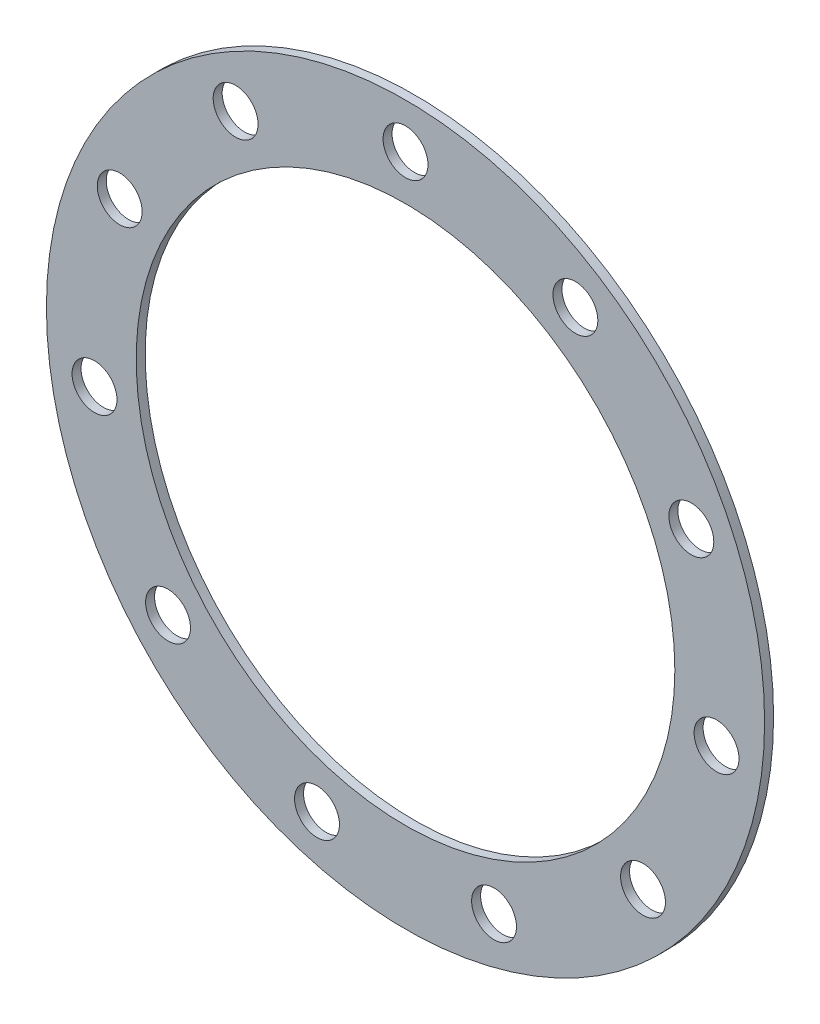
ISO-10303-21;
HEADER;
FILE_DESCRIPTION(('STEP AP214'),'2;1');
FILE_NAME('part.step','',(''),(''),'','','');
FILE_SCHEMA(('AUTOMOTIVE_DESIGN { 1 0 10303 214 1 1 1 1 }'));
ENDSEC;
DATA;
#1=APPLICATION_CONTEXT('core data for automotive mechanical design processes');
#2=APPLICATION_PROTOCOL_DEFINITION('international standard','automotive_design',2000,#1);
#3=PRODUCT_CONTEXT('',#1,'mechanical');
#4=PRODUCT('Part','Part','',(#3));
#5=PRODUCT_RELATED_PRODUCT_CATEGORY('part','',(#4));
#6=PRODUCT_DEFINITION_FORMATION('','',#4);
#7=PRODUCT_DEFINITION_CONTEXT('part definition',#1,'design');
#8=PRODUCT_DEFINITION('design','',#6,#7);
#9=PRODUCT_DEFINITION_SHAPE('','',#8);
#10=(LENGTH_UNIT() NAMED_UNIT(*) SI_UNIT(.MILLI.,.METRE.));
#11=(NAMED_UNIT(*) PLANE_ANGLE_UNIT() SI_UNIT($,.RADIAN.));
#12=(NAMED_UNIT(*) SI_UNIT($,.STERADIAN.) SOLID_ANGLE_UNIT());
#13=UNCERTAINTY_MEASURE_WITH_UNIT(LENGTH_MEASURE(1.E-05),#10,'distance_accuracy_value','');
#14=(GEOMETRIC_REPRESENTATION_CONTEXT(3) GLOBAL_UNCERTAINTY_ASSIGNED_CONTEXT((#13)) GLOBAL_UNIT_ASSIGNED_CONTEXT((#10,
#11,#12)) REPRESENTATION_CONTEXT('',''));
#15=CARTESIAN_POINT('',(0.,0.,0.));
#16=DIRECTION('',(0.,0.,1.));
#17=DIRECTION('',(1.,0.,0.));
#18=AXIS2_PLACEMENT_3D('',#15,#16,#17);
#19=CARTESIAN_POINT('',(0.,0.,1.));
#20=DIRECTION('',(0.,0.,1.));
#21=DIRECTION('',(1.,0.,0.));
#22=AXIS2_PLACEMENT_3D('',#19,#20,#21);
#23=PLANE('',#22);
#24=CARTESIAN_POINT('',(-31.8371198374073,14.5395254550647,1.));
#25=DIRECTION('',(0.,0.,1.));
#26=DIRECTION('',(1.,0.,0.));
#27=AXIS2_PLACEMENT_3D('',#24,#25,#26);
#28=CIRCLE('',#27,2.50000000000164);
#29=CARTESIAN_POINT('',(-29.3371198374056,14.5395254550647,1.));
#30=VERTEX_POINT('',#29);
#31=EDGE_CURVE('E104',#30,#30,#28,.T.);
#32=ORIENTED_EDGE('',*,*,#31,.F.);
#33=EDGE_LOOP('',(#32));
#34=FACE_BOUND('',#33,.T.);
#35=CARTESIAN_POINT('',(-26.4512351023966,-22.9201256880861,1.));
#36=DIRECTION('',(0.,0.,1.));
#37=DIRECTION('',(1.,0.,0.));
#38=AXIS2_PLACEMENT_3D('',#35,#36,#37);
#39=CIRCLE('',#38,2.50000000000299);
#40=CARTESIAN_POINT('',(-23.9512351023936,-22.9201256880861,1.));
#41=VERTEX_POINT('',#40);
#42=EDGE_CURVE('E92',#41,#41,#39,.T.);
#43=ORIENTED_EDGE('',*,*,#42,.F.);
#44=EDGE_LOOP('',(#43));
#45=FACE_BOUND('',#44,.T.);
#46=CARTESIAN_POINT('',(9.86063948945295,-33.582254076507,1.));
#47=DIRECTION('',(0.,0.,1.));
#48=DIRECTION('',(1.,0.,0.));
#49=AXIS2_PLACEMENT_3D('',#46,#47,#48);
#50=CIRCLE('',#49,2.50000000000289);
#51=CARTESIAN_POINT('',(12.3606394894558,-33.582254076507,1.));
#52=VERTEX_POINT('',#51);
#53=EDGE_CURVE('E80',#52,#52,#50,.T.);
#54=ORIENTED_EDGE('',*,*,#53,.F.);
#55=EDGE_LOOP('',(#54));
#56=FACE_BOUND('',#55,.T.);
#57=CARTESIAN_POINT('',(34.6437504658343,-4.98101933956351,1.));
#58=DIRECTION('',(0.,0.,1.));
#59=DIRECTION('',(1.,0.,0.));
#60=AXIS2_PLACEMENT_3D('',#57,#58,#59);
#61=CIRCLE('',#60,2.50000000000133);
#62=CARTESIAN_POINT('',(37.1437504658357,-4.98101933956351,1.));
#63=VERTEX_POINT('',#62);
#64=EDGE_CURVE('E68',#63,#63,#61,.T.);
#65=ORIENTED_EDGE('',*,*,#64,.F.);
#66=EDGE_LOOP('',(#65));
#67=FACE_BOUND('',#66,.T.);
#68=CARTESIAN_POINT('',(18.922428610946,29.4438736490913,1.));
#69=DIRECTION('',(0.,0.,1.));
#70=DIRECTION('',(1.,0.,0.));
#71=AXIS2_PLACEMENT_3D('',#68,#69,#70);
#72=CIRCLE('',#71,2.5);
#73=CARTESIAN_POINT('',(21.422428610946,29.4438736490913,1.));
#74=VERTEX_POINT('',#73);
#75=EDGE_CURVE('E56',#74,#74,#72,.T.);
#76=ORIENTED_EDGE('',*,*,#75,.F.);
#77=EDGE_LOOP('',(#76));
#78=FACE_BOUND('',#77,.T.);
#79=CARTESIAN_POINT('',(0.,0.,1.));
#80=DIRECTION('',(0.,0.,1.));
#81=DIRECTION('',(1.,0.,0.));
#82=AXIS2_PLACEMENT_3D('',#79,#80,#81);
#83=CIRCLE('',#82,30.);
#84=CARTESIAN_POINT('',(30.,0.,1.));
#85=VERTEX_POINT('',#84);
#86=EDGE_CURVE('E45',#85,#85,#83,.T.);
#87=ORIENTED_EDGE('',*,*,#86,.F.);
#88=EDGE_LOOP('',(#87));
#89=FACE_BOUND('',#88,.T.);
#90=CARTESIAN_POINT('',(0.,0.,1.));
#91=DIRECTION('',(0.,0.,1.));
#92=DIRECTION('',(1.,0.,0.));
#93=AXIS2_PLACEMENT_3D('',#90,#91,#92);
#94=CIRCLE('',#93,40.);
#95=CARTESIAN_POINT('',(40.,0.,1.));
#96=VERTEX_POINT('',#95);
#97=EDGE_CURVE('E10',#96,#96,#94,.T.);
#98=ORIENTED_EDGE('',*,*,#97,.T.);
#99=EDGE_LOOP('',(#98));
#100=FACE_BOUND('',#99,.T.);
#101=CARTESIAN_POINT('',(0.,35.,1.));
#102=DIRECTION('',(0.,0.,1.));
#103=DIRECTION('',(1.,0.,0.));
#104=AXIS2_PLACEMENT_3D('',#101,#102,#103);
#105=CIRCLE('',#104,2.5);
#106=CARTESIAN_POINT('',(2.5,35.,1.));
#107=VERTEX_POINT('',#106);
#108=EDGE_CURVE('E50',#107,#107,#105,.T.);
#109=ORIENTED_EDGE('',*,*,#108,.F.);
#110=EDGE_LOOP('',(#109));
#111=FACE_BOUND('',#110,.T.);
#112=CARTESIAN_POINT('',(31.837119837409,14.5395254550674,1.));
#113=DIRECTION('',(0.,0.,1.));
#114=DIRECTION('',(1.,0.,0.));
#115=AXIS2_PLACEMENT_3D('',#112,#113,#114);
#116=CIRCLE('',#115,2.50000000000053);
#117=CARTESIAN_POINT('',(34.3371198374095,14.5395254550674,1.));
#118=VERTEX_POINT('',#117);
#119=EDGE_CURVE('E62',#118,#118,#116,.T.);
#120=ORIENTED_EDGE('',*,*,#119,.F.);
#121=EDGE_LOOP('',(#120));
#122=FACE_BOUND('',#121,.T.);
#123=CARTESIAN_POINT('',(26.4512351024015,-22.9201256880839,1.));
#124=DIRECTION('',(0.,0.,1.));
#125=DIRECTION('',(1.,0.,0.));
#126=AXIS2_PLACEMENT_3D('',#123,#124,#125);
#127=CIRCLE('',#126,2.5000000000022);
#128=CARTESIAN_POINT('',(28.9512351024037,-22.9201256880839,1.));
#129=VERTEX_POINT('',#128);
#130=EDGE_CURVE('E74',#129,#129,#127,.T.);
#131=ORIENTED_EDGE('',*,*,#130,.F.);
#132=EDGE_LOOP('',(#131));
#133=FACE_BOUND('',#132,.T.);
#134=CARTESIAN_POINT('',(-9.86063948944712,-33.5822540765078,1.));
#135=DIRECTION('',(0.,0.,1.));
#136=DIRECTION('',(1.,0.,0.));
#137=AXIS2_PLACEMENT_3D('',#134,#135,#136);
#138=CIRCLE('',#137,2.50000000000318);
#139=CARTESIAN_POINT('',(-7.36063948944395,-33.5822540765078,1.));
#140=VERTEX_POINT('',#139);
#141=EDGE_CURVE('E86',#140,#140,#138,.T.);
#142=ORIENTED_EDGE('',*,*,#141,.F.);
#143=EDGE_LOOP('',(#142));
#144=FACE_BOUND('',#143,.T.);
#145=CARTESIAN_POINT('',(-34.6437504658309,-4.98101933956645,1.));
#146=DIRECTION('',(0.,0.,1.));
#147=DIRECTION('',(1.,0.,0.));
#148=AXIS2_PLACEMENT_3D('',#145,#146,#147);
#149=CIRCLE('',#148,2.50000000000241);
#150=CARTESIAN_POINT('',(-32.1437504658285,-4.98101933956645,1.));
#151=VERTEX_POINT('',#150);
#152=EDGE_CURVE('E98',#151,#151,#149,.T.);
#153=ORIENTED_EDGE('',*,*,#152,.F.);
#154=EDGE_LOOP('',(#153));
#155=FACE_BOUND('',#154,.T.);
#156=CARTESIAN_POINT('',(-18.9224286109457,29.4438736490905,1.));
#157=DIRECTION('',(0.,0.,1.));
#158=DIRECTION('',(1.,0.,0.));
#159=AXIS2_PLACEMENT_3D('',#156,#157,#158);
#160=CIRCLE('',#159,2.50000000000091);
#161=CARTESIAN_POINT('',(-16.4224286109448,29.4438736490905,1.));
#162=VERTEX_POINT('',#161);
#163=EDGE_CURVE('E110',#162,#162,#160,.T.);
#164=ORIENTED_EDGE('',*,*,#163,.F.);
#165=EDGE_LOOP('',(#164));
#166=FACE_BOUND('',#165,.T.);
#167=ADVANCED_FACE('F34',(#34,#45,#56,#67,#78,#89,#100,#111,#122,#133,#144,#155,#166),#23,.T.);
#168=CARTESIAN_POINT('',(0.,0.,0.));
#169=DIRECTION('',(0.,0.,1.));
#170=DIRECTION('',(1.,0.,0.));
#171=AXIS2_PLACEMENT_3D('',#168,#169,#170);
#172=PLANE('',#171);
#173=CARTESIAN_POINT('',(0.,0.,0.));
#174=DIRECTION('',(0.,0.,1.));
#175=DIRECTION('',(1.,0.,0.));
#176=AXIS2_PLACEMENT_3D('',#173,#174,#175);
#177=CIRCLE('',#176,40.);
#178=CARTESIAN_POINT('',(40.,0.,0.));
#179=VERTEX_POINT('',#178);
#180=EDGE_CURVE('E38',#179,#179,#177,.T.);
#181=ORIENTED_EDGE('',*,*,#180,.F.);
#182=EDGE_LOOP('',(#181));
#183=FACE_BOUND('',#182,.T.);
#184=CARTESIAN_POINT('',(0.,0.,0.));
#185=DIRECTION('',(0.,0.,1.));
#186=DIRECTION('',(1.,0.,0.));
#187=AXIS2_PLACEMENT_3D('',#184,#185,#186);
#188=CIRCLE('',#187,30.);
#189=CARTESIAN_POINT('',(30.,0.,0.));
#190=VERTEX_POINT('',#189);
#191=EDGE_CURVE('E47',#190,#190,#188,.T.);
#192=ORIENTED_EDGE('',*,*,#191,.T.);
#193=EDGE_LOOP('',(#192));
#194=FACE_BOUND('',#193,.T.);
#195=CARTESIAN_POINT('',(0.,35.,0.));
#196=DIRECTION('',(0.,0.,1.));
#197=DIRECTION('',(1.,0.,0.));
#198=AXIS2_PLACEMENT_3D('',#195,#196,#197);
#199=CIRCLE('',#198,2.5);
#200=CARTESIAN_POINT('',(2.5,35.,0.));
#201=VERTEX_POINT('',#200);
#202=EDGE_CURVE('E53',#201,#201,#199,.T.);
#203=ORIENTED_EDGE('',*,*,#202,.T.);
#204=EDGE_LOOP('',(#203));
#205=FACE_BOUND('',#204,.T.);
#206=CARTESIAN_POINT('',(18.922428610946,29.4438736490913,0.));
#207=DIRECTION('',(0.,0.,1.));
#208=DIRECTION('',(1.,0.,0.));
#209=AXIS2_PLACEMENT_3D('',#206,#207,#208);
#210=CIRCLE('',#209,2.5);
#211=CARTESIAN_POINT('',(21.422428610946,29.4438736490913,0.));
#212=VERTEX_POINT('',#211);
#213=EDGE_CURVE('E59',#212,#212,#210,.T.);
#214=ORIENTED_EDGE('',*,*,#213,.T.);
#215=EDGE_LOOP('',(#214));
#216=FACE_BOUND('',#215,.T.);
#217=CARTESIAN_POINT('',(31.837119837409,14.5395254550674,0.));
#218=DIRECTION('',(0.,0.,1.));
#219=DIRECTION('',(1.,0.,0.));
#220=AXIS2_PLACEMENT_3D('',#217,#218,#219);
#221=CIRCLE('',#220,2.50000000000053);
#222=CARTESIAN_POINT('',(34.3371198374095,14.5395254550674,0.));
#223=VERTEX_POINT('',#222);
#224=EDGE_CURVE('E65',#223,#223,#221,.T.);
#225=ORIENTED_EDGE('',*,*,#224,.T.);
#226=EDGE_LOOP('',(#225));
#227=FACE_BOUND('',#226,.T.);
#228=CARTESIAN_POINT('',(34.6437504658343,-4.98101933956351,0.));
#229=DIRECTION('',(0.,0.,1.));
#230=DIRECTION('',(1.,0.,0.));
#231=AXIS2_PLACEMENT_3D('',#228,#229,#230);
#232=CIRCLE('',#231,2.50000000000133);
#233=CARTESIAN_POINT('',(37.1437504658357,-4.98101933956351,0.));
#234=VERTEX_POINT('',#233);
#235=EDGE_CURVE('E71',#234,#234,#232,.T.);
#236=ORIENTED_EDGE('',*,*,#235,.T.);
#237=EDGE_LOOP('',(#236));
#238=FACE_BOUND('',#237,.T.);
#239=CARTESIAN_POINT('',(26.4512351024015,-22.9201256880839,0.));
#240=DIRECTION('',(0.,0.,1.));
#241=DIRECTION('',(1.,0.,0.));
#242=AXIS2_PLACEMENT_3D('',#239,#240,#241);
#243=CIRCLE('',#242,2.5000000000022);
#244=CARTESIAN_POINT('',(28.9512351024037,-22.9201256880839,0.));
#245=VERTEX_POINT('',#244);
#246=EDGE_CURVE('E77',#245,#245,#243,.T.);
#247=ORIENTED_EDGE('',*,*,#246,.T.);
#248=EDGE_LOOP('',(#247));
#249=FACE_BOUND('',#248,.T.);
#250=CARTESIAN_POINT('',(9.86063948945295,-33.582254076507,0.));
#251=DIRECTION('',(0.,0.,1.));
#252=DIRECTION('',(1.,0.,0.));
#253=AXIS2_PLACEMENT_3D('',#250,#251,#252);
#254=CIRCLE('',#253,2.50000000000289);
#255=CARTESIAN_POINT('',(12.3606394894558,-33.582254076507,0.));
#256=VERTEX_POINT('',#255);
#257=EDGE_CURVE('E83',#256,#256,#254,.T.);
#258=ORIENTED_EDGE('',*,*,#257,.T.);
#259=EDGE_LOOP('',(#258));
#260=FACE_BOUND('',#259,.T.);
#261=CARTESIAN_POINT('',(-9.86063948944712,-33.5822540765078,0.));
#262=DIRECTION('',(0.,0.,1.));
#263=DIRECTION('',(1.,0.,0.));
#264=AXIS2_PLACEMENT_3D('',#261,#262,#263);
#265=CIRCLE('',#264,2.50000000000318);
#266=CARTESIAN_POINT('',(-7.36063948944395,-33.5822540765078,0.));
#267=VERTEX_POINT('',#266);
#268=EDGE_CURVE('E89',#267,#267,#265,.T.);
#269=ORIENTED_EDGE('',*,*,#268,.T.);
#270=EDGE_LOOP('',(#269));
#271=FACE_BOUND('',#270,.T.);
#272=CARTESIAN_POINT('',(-26.4512351023966,-22.9201256880861,0.));
#273=DIRECTION('',(0.,0.,1.));
#274=DIRECTION('',(1.,0.,0.));
#275=AXIS2_PLACEMENT_3D('',#272,#273,#274);
#276=CIRCLE('',#275,2.50000000000299);
#277=CARTESIAN_POINT('',(-23.9512351023936,-22.9201256880861,0.));
#278=VERTEX_POINT('',#277);
#279=EDGE_CURVE('E95',#278,#278,#276,.T.);
#280=ORIENTED_EDGE('',*,*,#279,.T.);
#281=EDGE_LOOP('',(#280));
#282=FACE_BOUND('',#281,.T.);
#283=CARTESIAN_POINT('',(-34.6437504658309,-4.98101933956645,0.));
#284=DIRECTION('',(0.,0.,1.));
#285=DIRECTION('',(1.,0.,0.));
#286=AXIS2_PLACEMENT_3D('',#283,#284,#285);
#287=CIRCLE('',#286,2.50000000000241);
#288=CARTESIAN_POINT('',(-32.1437504658285,-4.98101933956645,0.));
#289=VERTEX_POINT('',#288);
#290=EDGE_CURVE('E101',#289,#289,#287,.T.);
#291=ORIENTED_EDGE('',*,*,#290,.T.);
#292=EDGE_LOOP('',(#291));
#293=FACE_BOUND('',#292,.T.);
#294=CARTESIAN_POINT('',(-31.8371198374073,14.5395254550647,0.));
#295=DIRECTION('',(0.,0.,1.));
#296=DIRECTION('',(1.,0.,0.));
#297=AXIS2_PLACEMENT_3D('',#294,#295,#296);
#298=CIRCLE('',#297,2.50000000000164);
#299=CARTESIAN_POINT('',(-29.3371198374056,14.5395254550647,0.));
#300=VERTEX_POINT('',#299);
#301=EDGE_CURVE('E107',#300,#300,#298,.T.);
#302=ORIENTED_EDGE('',*,*,#301,.T.);
#303=EDGE_LOOP('',(#302));
#304=FACE_BOUND('',#303,.T.);
#305=CARTESIAN_POINT('',(-18.9224286109457,29.4438736490905,0.));
#306=DIRECTION('',(0.,0.,1.));
#307=DIRECTION('',(1.,0.,0.));
#308=AXIS2_PLACEMENT_3D('',#305,#306,#307);
#309=CIRCLE('',#308,2.50000000000091);
#310=CARTESIAN_POINT('',(-16.4224286109448,29.4438736490905,0.));
#311=VERTEX_POINT('',#310);
#312=EDGE_CURVE('E113',#311,#311,#309,.T.);
#313=ORIENTED_EDGE('',*,*,#312,.T.);
#314=EDGE_LOOP('',(#313));
#315=FACE_BOUND('',#314,.T.);
#316=ADVANCED_FACE('F123',(#183,#194,#205,#216,#227,#238,#249,#260,#271,#282,#293,#304,#315),
#172,.F.);
#317=CARTESIAN_POINT('',(0.,0.,1.));
#318=DIRECTION('',(0.,0.,-1.));
#319=DIRECTION('',(-1.,0.,0.));
#320=AXIS2_PLACEMENT_3D('',#317,#318,#319);
#321=CYLINDRICAL_SURFACE('',#320,40.);
#322=ORIENTED_EDGE('',*,*,#97,.F.);
#323=EDGE_LOOP('',(#322));
#324=FACE_BOUND('',#323,.T.);
#325=ORIENTED_EDGE('',*,*,#180,.T.);
#326=EDGE_LOOP('',(#325));
#327=FACE_BOUND('',#326,.T.);
#328=ADVANCED_FACE('F36',(#324,#327),#321,.T.);
#329=CARTESIAN_POINT('',(0.,0.,1.));
#330=DIRECTION('',(0.,0.,-1.));
#331=DIRECTION('',(-1.,0.,0.));
#332=AXIS2_PLACEMENT_3D('',#329,#330,#331);
#333=CYLINDRICAL_SURFACE('',#332,30.);
#334=ORIENTED_EDGE('',*,*,#86,.T.);
#335=EDGE_LOOP('',(#334));
#336=FACE_BOUND('',#335,.T.);
#337=ORIENTED_EDGE('',*,*,#191,.F.);
#338=EDGE_LOOP('',(#337));
#339=FACE_BOUND('',#338,.T.);
#340=ADVANCED_FACE('F133',(#336,#339),#333,.F.);
#341=CARTESIAN_POINT('',(0.,35.,1.));
#342=DIRECTION('',(0.,0.,-1.));
#343=DIRECTION('',(-1.,0.,0.));
#344=AXIS2_PLACEMENT_3D('',#341,#342,#343);
#345=CYLINDRICAL_SURFACE('',#344,2.5);
#346=ORIENTED_EDGE('',*,*,#108,.T.);
#347=EDGE_LOOP('',(#346));
#348=FACE_BOUND('',#347,.T.);
#349=ORIENTED_EDGE('',*,*,#202,.F.);
#350=EDGE_LOOP('',(#349));
#351=FACE_BOUND('',#350,.T.);
#352=ADVANCED_FACE('F136',(#348,#351),#345,.F.);
#353=CARTESIAN_POINT('',(18.922428610946,29.4438736490913,1.));
#354=DIRECTION('',(0.,0.,-1.));
#355=DIRECTION('',(-1.,0.,0.));
#356=AXIS2_PLACEMENT_3D('',#353,#354,#355);
#357=CYLINDRICAL_SURFACE('',#356,2.5);
#358=ORIENTED_EDGE('',*,*,#75,.T.);
#359=EDGE_LOOP('',(#358));
#360=FACE_BOUND('',#359,.T.);
#361=ORIENTED_EDGE('',*,*,#213,.F.);
#362=EDGE_LOOP('',(#361));
#363=FACE_BOUND('',#362,.T.);
#364=ADVANCED_FACE('F140',(#360,#363),#357,.F.);
#365=CARTESIAN_POINT('',(31.837119837409,14.5395254550674,1.));
#366=DIRECTION('',(0.,0.,-1.));
#367=DIRECTION('',(-1.,0.,0.));
#368=AXIS2_PLACEMENT_3D('',#365,#366,#367);
#369=CYLINDRICAL_SURFACE('',#368,2.50000000000053);
#370=ORIENTED_EDGE('',*,*,#119,.T.);
#371=EDGE_LOOP('',(#370));
#372=FACE_BOUND('',#371,.T.);
#373=ORIENTED_EDGE('',*,*,#224,.F.);
#374=EDGE_LOOP('',(#373));
#375=FACE_BOUND('',#374,.T.);
#376=ADVANCED_FACE('F144',(#372,#375),#369,.F.);
#377=CARTESIAN_POINT('',(34.6437504658343,-4.98101933956351,1.));
#378=DIRECTION('',(0.,0.,-1.));
#379=DIRECTION('',(-1.,0.,0.));
#380=AXIS2_PLACEMENT_3D('',#377,#378,#379);
#381=CYLINDRICAL_SURFACE('',#380,2.50000000000133);
#382=ORIENTED_EDGE('',*,*,#64,.T.);
#383=EDGE_LOOP('',(#382));
#384=FACE_BOUND('',#383,.T.);
#385=ORIENTED_EDGE('',*,*,#235,.F.);
#386=EDGE_LOOP('',(#385));
#387=FACE_BOUND('',#386,.T.);
#388=ADVANCED_FACE('F148',(#384,#387),#381,.F.);
#389=CARTESIAN_POINT('',(26.4512351024015,-22.9201256880839,1.));
#390=DIRECTION('',(0.,0.,-1.));
#391=DIRECTION('',(-1.,0.,0.));
#392=AXIS2_PLACEMENT_3D('',#389,#390,#391);
#393=CYLINDRICAL_SURFACE('',#392,2.5000000000022);
#394=ORIENTED_EDGE('',*,*,#130,.T.);
#395=EDGE_LOOP('',(#394));
#396=FACE_BOUND('',#395,.T.);
#397=ORIENTED_EDGE('',*,*,#246,.F.);
#398=EDGE_LOOP('',(#397));
#399=FACE_BOUND('',#398,.T.);
#400=ADVANCED_FACE('F152',(#396,#399),#393,.F.);
#401=CARTESIAN_POINT('',(9.86063948945295,-33.582254076507,1.));
#402=DIRECTION('',(0.,0.,-1.));
#403=DIRECTION('',(-1.,0.,0.));
#404=AXIS2_PLACEMENT_3D('',#401,#402,#403);
#405=CYLINDRICAL_SURFACE('',#404,2.50000000000289);
#406=ORIENTED_EDGE('',*,*,#53,.T.);
#407=EDGE_LOOP('',(#406));
#408=FACE_BOUND('',#407,.T.);
#409=ORIENTED_EDGE('',*,*,#257,.F.);
#410=EDGE_LOOP('',(#409));
#411=FACE_BOUND('',#410,.T.);
#412=ADVANCED_FACE('F156',(#408,#411),#405,.F.);
#413=CARTESIAN_POINT('',(-9.86063948944712,-33.5822540765078,1.));
#414=DIRECTION('',(0.,0.,-1.));
#415=DIRECTION('',(-1.,0.,0.));
#416=AXIS2_PLACEMENT_3D('',#413,#414,#415);
#417=CYLINDRICAL_SURFACE('',#416,2.50000000000318);
#418=ORIENTED_EDGE('',*,*,#141,.T.);
#419=EDGE_LOOP('',(#418));
#420=FACE_BOUND('',#419,.T.);
#421=ORIENTED_EDGE('',*,*,#268,.F.);
#422=EDGE_LOOP('',(#421));
#423=FACE_BOUND('',#422,.T.);
#424=ADVANCED_FACE('F160',(#420,#423),#417,.F.);
#425=CARTESIAN_POINT('',(-26.4512351023966,-22.9201256880861,1.));
#426=DIRECTION('',(0.,0.,-1.));
#427=DIRECTION('',(-1.,0.,0.));
#428=AXIS2_PLACEMENT_3D('',#425,#426,#427);
#429=CYLINDRICAL_SURFACE('',#428,2.50000000000299);
#430=ORIENTED_EDGE('',*,*,#42,.T.);
#431=EDGE_LOOP('',(#430));
#432=FACE_BOUND('',#431,.T.);
#433=ORIENTED_EDGE('',*,*,#279,.F.);
#434=EDGE_LOOP('',(#433));
#435=FACE_BOUND('',#434,.T.);
#436=ADVANCED_FACE('F164',(#432,#435),#429,.F.);
#437=CARTESIAN_POINT('',(-34.6437504658309,-4.98101933956645,1.));
#438=DIRECTION('',(0.,0.,-1.));
#439=DIRECTION('',(-1.,0.,0.));
#440=AXIS2_PLACEMENT_3D('',#437,#438,#439);
#441=CYLINDRICAL_SURFACE('',#440,2.50000000000241);
#442=ORIENTED_EDGE('',*,*,#152,.T.);
#443=EDGE_LOOP('',(#442));
#444=FACE_BOUND('',#443,.T.);
#445=ORIENTED_EDGE('',*,*,#290,.F.);
#446=EDGE_LOOP('',(#445));
#447=FACE_BOUND('',#446,.T.);
#448=ADVANCED_FACE('F168',(#444,#447),#441,.F.);
#449=CARTESIAN_POINT('',(-31.8371198374073,14.5395254550647,1.));
#450=DIRECTION('',(0.,0.,-1.));
#451=DIRECTION('',(-1.,0.,0.));
#452=AXIS2_PLACEMENT_3D('',#449,#450,#451);
#453=CYLINDRICAL_SURFACE('',#452,2.50000000000164);
#454=ORIENTED_EDGE('',*,*,#31,.T.);
#455=EDGE_LOOP('',(#454));
#456=FACE_BOUND('',#455,.T.);
#457=ORIENTED_EDGE('',*,*,#301,.F.);
#458=EDGE_LOOP('',(#457));
#459=FACE_BOUND('',#458,.T.);
#460=ADVANCED_FACE('F172',(#456,#459),#453,.F.);
#461=CARTESIAN_POINT('',(-18.9224286109457,29.4438736490905,1.));
#462=DIRECTION('',(0.,0.,-1.));
#463=DIRECTION('',(-1.,0.,0.));
#464=AXIS2_PLACEMENT_3D('',#461,#462,#463);
#465=CYLINDRICAL_SURFACE('',#464,2.50000000000091);
#466=ORIENTED_EDGE('',*,*,#163,.T.);
#467=EDGE_LOOP('',(#466));
#468=FACE_BOUND('',#467,.T.);
#469=ORIENTED_EDGE('',*,*,#312,.F.);
#470=EDGE_LOOP('',(#469));
#471=FACE_BOUND('',#470,.T.);
#472=ADVANCED_FACE('F119',(#468,#471),#465,.F.);
#473=CLOSED_SHELL('',(#167,#316,#328,#340,#352,#364,#376,#388,#400,#412,#424,#436,#448,#460,#472));
#474=MANIFOLD_SOLID_BREP('B2',#473);
#475=ADVANCED_BREP_SHAPE_REPRESENTATION('',(#18,#474),#14);
#476=SHAPE_DEFINITION_REPRESENTATION(#9,#475);
ENDSEC;
END-ISO-10303-21;
